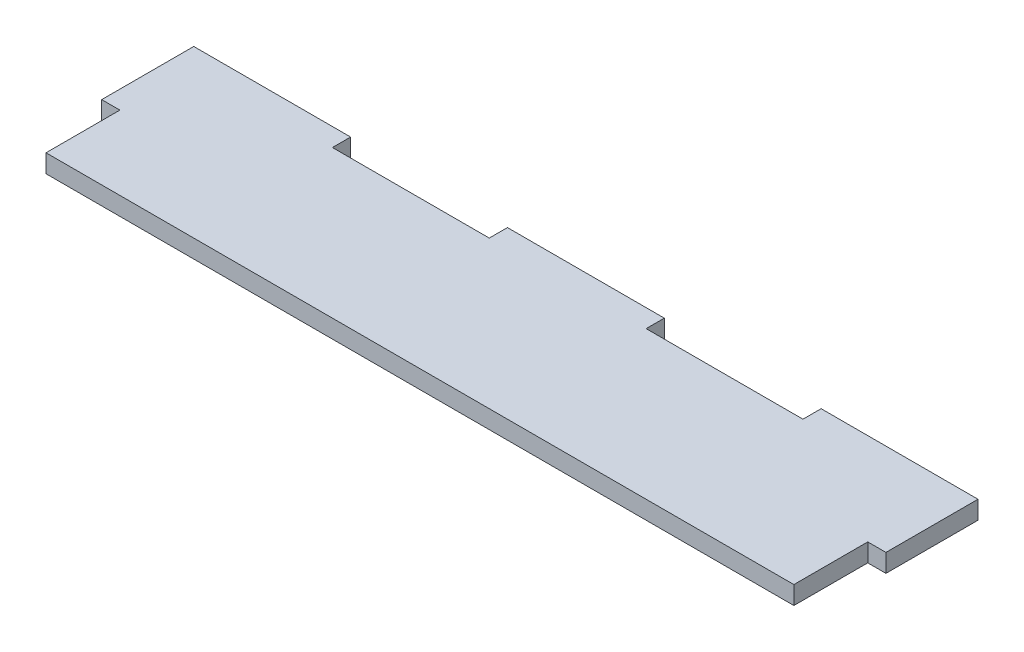
ISO-10303-21;
HEADER;
FILE_DESCRIPTION(('STEP AP214'),'2;1');
FILE_NAME('part.step','',(''),(''),'','','');
FILE_SCHEMA(('AUTOMOTIVE_DESIGN { 1 0 10303 214 1 1 1 1 }'));
ENDSEC;
DATA;
#1=APPLICATION_CONTEXT('core data for automotive mechanical design processes');
#2=APPLICATION_PROTOCOL_DEFINITION('international standard','automotive_design',2000,#1);
#3=PRODUCT_CONTEXT('',#1,'mechanical');
#4=PRODUCT('Part','Part','',(#3));
#5=PRODUCT_RELATED_PRODUCT_CATEGORY('part','',(#4));
#6=PRODUCT_DEFINITION_FORMATION('','',#4);
#7=PRODUCT_DEFINITION_CONTEXT('part definition',#1,'design');
#8=PRODUCT_DEFINITION('design','',#6,#7);
#9=PRODUCT_DEFINITION_SHAPE('','',#8);
#10=(LENGTH_UNIT() NAMED_UNIT(*) SI_UNIT(.MILLI.,.METRE.));
#11=(NAMED_UNIT(*) PLANE_ANGLE_UNIT() SI_UNIT($,.RADIAN.));
#12=(NAMED_UNIT(*) SI_UNIT($,.STERADIAN.) SOLID_ANGLE_UNIT());
#13=UNCERTAINTY_MEASURE_WITH_UNIT(LENGTH_MEASURE(1.E-05),#10,'distance_accuracy_value','');
#14=(GEOMETRIC_REPRESENTATION_CONTEXT(3) GLOBAL_UNCERTAINTY_ASSIGNED_CONTEXT((#13)) GLOBAL_UNIT_ASSIGNED_CONTEXT((#10,
#11,#12)) REPRESENTATION_CONTEXT('',''));
#15=CARTESIAN_POINT('',(0.,0.,0.));
#16=DIRECTION('',(0.,0.,1.));
#17=DIRECTION('',(1.,0.,0.));
#18=AXIS2_PLACEMENT_3D('',#15,#16,#17);
#19=CARTESIAN_POINT('',(0.,10.16,51.4350000000003));
#20=DIRECTION('',(0.,0.,1.));
#21=DIRECTION('',(1.,0.,0.));
#22=AXIS2_PLACEMENT_3D('',#19,#20,#21);
#23=PLANE('',#22);
#24=DIRECTION('',(-1.,0.,0.));
#25=VECTOR('',#24,1.);
#26=CARTESIAN_POINT('',(0.,0.,51.4350000000003));
#27=LINE('',#26,#25);
#28=CARTESIAN_POINT('',(438.15,0.,51.435));
#29=VERTEX_POINT('',#28);
#30=CARTESIAN_POINT('',(427.99,0.,51.435));
#31=VERTEX_POINT('',#30);
#32=EDGE_CURVE('E176',#29,#31,#27,.T.);
#33=ORIENTED_EDGE('',*,*,#32,.F.);
#34=DIRECTION('',(0.,-1.,0.));
#35=VECTOR('',#34,1.);
#36=CARTESIAN_POINT('',(438.15,10.16,51.435));
#37=LINE('',#36,#35);
#38=CARTESIAN_POINT('',(438.15,10.16,51.435));
#39=VERTEX_POINT('',#38);
#40=EDGE_CURVE('E11',#39,#29,#37,.T.);
#41=ORIENTED_EDGE('',*,*,#40,.F.);
#42=DIRECTION('',(-1.,0.,0.));
#43=VECTOR('',#42,1.);
#44=CARTESIAN_POINT('',(0.,10.16,51.4350000000003));
#45=LINE('',#44,#43);
#46=CARTESIAN_POINT('',(427.99,10.16,51.435));
#47=VERTEX_POINT('',#46);
#48=EDGE_CURVE('E216',#39,#47,#45,.T.);
#49=ORIENTED_EDGE('',*,*,#48,.T.);
#50=DIRECTION('',(0.,-1.,0.));
#51=VECTOR('',#50,1.);
#52=CARTESIAN_POINT('',(427.99,10.16,51.435));
#53=LINE('',#52,#51);
#54=EDGE_CURVE('E51',#47,#31,#53,.T.);
#55=ORIENTED_EDGE('',*,*,#54,.T.);
#56=EDGE_LOOP('',(#33,#41,#49,#55));
#57=FACE_BOUND('',#56,.T.);
#58=ADVANCED_FACE('F35',(#57),#23,.T.);
#59=CARTESIAN_POINT('',(438.15,10.16,0.));
#60=DIRECTION('',(1.,0.,0.));
#61=DIRECTION('',(0.,0.,-1.));
#62=AXIS2_PLACEMENT_3D('',#59,#60,#61);
#63=PLANE('',#62);
#64=DIRECTION('',(0.,0.,1.));
#65=VECTOR('',#64,1.);
#66=CARTESIAN_POINT('',(438.15,0.,0.));
#67=LINE('',#66,#65);
#68=CARTESIAN_POINT('',(438.15,0.,0.));
#69=VERTEX_POINT('',#68);
#70=EDGE_CURVE('E178',#69,#29,#67,.T.);
#71=ORIENTED_EDGE('',*,*,#70,.F.);
#72=DIRECTION('',(0.,-1.,0.));
#73=VECTOR('',#72,1.);
#74=CARTESIAN_POINT('',(438.15,10.16,0.));
#75=LINE('',#74,#73);
#76=CARTESIAN_POINT('',(438.15,10.16,0.));
#77=VERTEX_POINT('',#76);
#78=EDGE_CURVE('E43',#77,#69,#75,.T.);
#79=ORIENTED_EDGE('',*,*,#78,.F.);
#80=DIRECTION('',(0.,0.,1.));
#81=VECTOR('',#80,1.);
#82=CARTESIAN_POINT('',(438.15,10.16,0.));
#83=LINE('',#82,#81);
#84=EDGE_CURVE('E262',#77,#39,#83,.T.);
#85=ORIENTED_EDGE('',*,*,#84,.T.);
#86=ORIENTED_EDGE('',*,*,#40,.T.);
#87=EDGE_LOOP('',(#71,#79,#85,#86));
#88=FACE_BOUND('',#87,.T.);
#89=ADVANCED_FACE('F250',(#88),#63,.T.);
#90=CARTESIAN_POINT('',(0.,10.16,0.));
#91=DIRECTION('',(0.,0.,-1.));
#92=DIRECTION('',(-1.,0.,0.));
#93=AXIS2_PLACEMENT_3D('',#90,#91,#92);
#94=PLANE('',#93);
#95=DIRECTION('',(1.,0.,0.));
#96=VECTOR('',#95,1.);
#97=CARTESIAN_POINT('',(0.,0.,0.));
#98=LINE('',#97,#96);
#99=CARTESIAN_POINT('',(350.52,0.,0.));
#100=VERTEX_POINT('',#99);
#101=EDGE_CURVE('E181',#100,#69,#98,.T.);
#102=ORIENTED_EDGE('',*,*,#101,.F.);
#103=DIRECTION('',(0.,-1.,0.));
#104=VECTOR('',#103,1.);
#105=CARTESIAN_POINT('',(350.52,10.16,0.));
#106=LINE('',#105,#104);
#107=CARTESIAN_POINT('',(350.52,10.16,0.));
#108=VERTEX_POINT('',#107);
#109=EDGE_CURVE('E239',#108,#100,#106,.T.);
#110=ORIENTED_EDGE('',*,*,#109,.F.);
#111=DIRECTION('',(1.,0.,0.));
#112=VECTOR('',#111,1.);
#113=CARTESIAN_POINT('',(0.,10.16,0.));
#114=LINE('',#113,#112);
#115=EDGE_CURVE('E246',#108,#77,#114,.T.);
#116=ORIENTED_EDGE('',*,*,#115,.T.);
#117=ORIENTED_EDGE('',*,*,#78,.T.);
#118=EDGE_LOOP('',(#102,#110,#116,#117));
#119=FACE_BOUND('',#118,.T.);
#120=ADVANCED_FACE('F244',(#119),#94,.T.);
#121=CARTESIAN_POINT('',(350.52,10.16,0.));
#122=DIRECTION('',(-1.,0.,0.));
#123=DIRECTION('',(0.,0.,1.));
#124=AXIS2_PLACEMENT_3D('',#121,#122,#123);
#125=PLANE('',#124);
#126=DIRECTION('',(0.,0.,-1.));
#127=VECTOR('',#126,1.);
#128=CARTESIAN_POINT('',(350.52,0.,0.));
#129=LINE('',#128,#127);
#130=CARTESIAN_POINT('',(350.52,0.,10.16));
#131=VERTEX_POINT('',#130);
#132=EDGE_CURVE('E184',#131,#100,#129,.T.);
#133=ORIENTED_EDGE('',*,*,#132,.F.);
#134=DIRECTION('',(0.,-1.,0.));
#135=VECTOR('',#134,1.);
#136=CARTESIAN_POINT('',(350.52,10.16,10.16));
#137=LINE('',#136,#135);
#138=CARTESIAN_POINT('',(350.52,10.16,10.16));
#139=VERTEX_POINT('',#138);
#140=EDGE_CURVE('E237',#139,#131,#137,.T.);
#141=ORIENTED_EDGE('',*,*,#140,.F.);
#142=DIRECTION('',(0.,0.,-1.));
#143=VECTOR('',#142,1.);
#144=CARTESIAN_POINT('',(350.52,10.16,0.));
#145=LINE('',#144,#143);
#146=EDGE_CURVE('E259',#139,#108,#145,.T.);
#147=ORIENTED_EDGE('',*,*,#146,.T.);
#148=ORIENTED_EDGE('',*,*,#109,.T.);
#149=EDGE_LOOP('',(#133,#141,#147,#148));
#150=FACE_BOUND('',#149,.T.);
#151=ADVANCED_FACE('F256',(#150),#125,.T.);
#152=CARTESIAN_POINT('',(0.,10.16,10.16));
#153=DIRECTION('',(0.,0.,-1.));
#154=DIRECTION('',(-1.,0.,0.));
#155=AXIS2_PLACEMENT_3D('',#152,#153,#154);
#156=PLANE('',#155);
#157=DIRECTION('',(1.,0.,0.));
#158=VECTOR('',#157,1.);
#159=CARTESIAN_POINT('',(0.,0.,10.16));
#160=LINE('',#159,#158);
#161=CARTESIAN_POINT('',(262.89,0.,10.16));
#162=VERTEX_POINT('',#161);
#163=EDGE_CURVE('E187',#162,#131,#160,.T.);
#164=ORIENTED_EDGE('',*,*,#163,.F.);
#165=DIRECTION('',(0.,-1.,0.));
#166=VECTOR('',#165,1.);
#167=CARTESIAN_POINT('',(262.89,10.16,10.16));
#168=LINE('',#167,#166);
#169=CARTESIAN_POINT('',(262.89,10.16,10.16));
#170=VERTEX_POINT('',#169);
#171=EDGE_CURVE('E235',#170,#162,#168,.T.);
#172=ORIENTED_EDGE('',*,*,#171,.F.);
#173=DIRECTION('',(1.,0.,0.));
#174=VECTOR('',#173,1.);
#175=CARTESIAN_POINT('',(0.,10.16,10.16));
#176=LINE('',#175,#174);
#177=EDGE_CURVE('E264',#170,#139,#176,.T.);
#178=ORIENTED_EDGE('',*,*,#177,.T.);
#179=ORIENTED_EDGE('',*,*,#140,.T.);
#180=EDGE_LOOP('',(#164,#172,#178,#179));
#181=FACE_BOUND('',#180,.T.);
#182=ADVANCED_FACE('F318',(#181),#156,.T.);
#183=CARTESIAN_POINT('',(262.89,10.16,0.));
#184=DIRECTION('',(1.,0.,0.));
#185=DIRECTION('',(0.,0.,-1.));
#186=AXIS2_PLACEMENT_3D('',#183,#184,#185);
#187=PLANE('',#186);
#188=DIRECTION('',(0.,0.,1.));
#189=VECTOR('',#188,1.);
#190=CARTESIAN_POINT('',(262.89,0.,0.));
#191=LINE('',#190,#189);
#192=CARTESIAN_POINT('',(262.89,0.,0.));
#193=VERTEX_POINT('',#192);
#194=EDGE_CURVE('E190',#193,#162,#191,.T.);
#195=ORIENTED_EDGE('',*,*,#194,.F.);
#196=DIRECTION('',(0.,-1.,0.));
#197=VECTOR('',#196,1.);
#198=CARTESIAN_POINT('',(262.89,10.16,0.));
#199=LINE('',#198,#197);
#200=CARTESIAN_POINT('',(262.89,10.16,0.));
#201=VERTEX_POINT('',#200);
#202=EDGE_CURVE('E233',#201,#193,#199,.T.);
#203=ORIENTED_EDGE('',*,*,#202,.F.);
#204=DIRECTION('',(0.,0.,1.));
#205=VECTOR('',#204,1.);
#206=CARTESIAN_POINT('',(262.89,10.16,0.));
#207=LINE('',#206,#205);
#208=EDGE_CURVE('E270',#201,#170,#207,.T.);
#209=ORIENTED_EDGE('',*,*,#208,.T.);
#210=ORIENTED_EDGE('',*,*,#171,.T.);
#211=EDGE_LOOP('',(#195,#203,#209,#210));
#212=FACE_BOUND('',#211,.T.);
#213=ADVANCED_FACE('F319',(#212),#187,.T.);
#214=CARTESIAN_POINT('',(0.,10.16,0.));
#215=DIRECTION('',(0.,0.,-1.));
#216=DIRECTION('',(-1.,0.,0.));
#217=AXIS2_PLACEMENT_3D('',#214,#215,#216);
#218=PLANE('',#217);
#219=DIRECTION('',(1.,0.,0.));
#220=VECTOR('',#219,1.);
#221=CARTESIAN_POINT('',(0.,0.,0.));
#222=LINE('',#221,#220);
#223=CARTESIAN_POINT('',(175.26,0.,0.));
#224=VERTEX_POINT('',#223);
#225=EDGE_CURVE('E194',#224,#193,#222,.T.);
#226=ORIENTED_EDGE('',*,*,#225,.F.);
#227=DIRECTION('',(0.,-1.,0.));
#228=VECTOR('',#227,1.);
#229=CARTESIAN_POINT('',(175.26,10.16,0.));
#230=LINE('',#229,#228);
#231=CARTESIAN_POINT('',(175.26,10.16,0.));
#232=VERTEX_POINT('',#231);
#233=EDGE_CURVE('E231',#232,#224,#230,.T.);
#234=ORIENTED_EDGE('',*,*,#233,.F.);
#235=DIRECTION('',(1.,0.,0.));
#236=VECTOR('',#235,1.);
#237=CARTESIAN_POINT('',(0.,10.16,0.));
#238=LINE('',#237,#236);
#239=EDGE_CURVE('E274',#232,#201,#238,.T.);
#240=ORIENTED_EDGE('',*,*,#239,.T.);
#241=ORIENTED_EDGE('',*,*,#202,.T.);
#242=EDGE_LOOP('',(#226,#234,#240,#241));
#243=FACE_BOUND('',#242,.T.);
#244=ADVANCED_FACE('F322',(#243),#218,.T.);
#245=CARTESIAN_POINT('',(175.26,10.16,0.));
#246=DIRECTION('',(-1.,0.,0.));
#247=DIRECTION('',(0.,0.,1.));
#248=AXIS2_PLACEMENT_3D('',#245,#246,#247);
#249=PLANE('',#248);
#250=DIRECTION('',(0.,0.,-1.));
#251=VECTOR('',#250,1.);
#252=CARTESIAN_POINT('',(175.26,0.,0.));
#253=LINE('',#252,#251);
#254=CARTESIAN_POINT('',(175.26,0.,10.16));
#255=VERTEX_POINT('',#254);
#256=EDGE_CURVE('E197',#255,#224,#253,.T.);
#257=ORIENTED_EDGE('',*,*,#256,.F.);
#258=DIRECTION('',(0.,-1.,0.));
#259=VECTOR('',#258,1.);
#260=CARTESIAN_POINT('',(175.26,10.16,10.16));
#261=LINE('',#260,#259);
#262=CARTESIAN_POINT('',(175.26,10.16,10.16));
#263=VERTEX_POINT('',#262);
#264=EDGE_CURVE('E229',#263,#255,#261,.T.);
#265=ORIENTED_EDGE('',*,*,#264,.F.);
#266=DIRECTION('',(0.,0.,-1.));
#267=VECTOR('',#266,1.);
#268=CARTESIAN_POINT('',(175.26,10.16,0.));
#269=LINE('',#268,#267);
#270=EDGE_CURVE('E277',#263,#232,#269,.T.);
#271=ORIENTED_EDGE('',*,*,#270,.T.);
#272=ORIENTED_EDGE('',*,*,#233,.T.);
#273=EDGE_LOOP('',(#257,#265,#271,#272));
#274=FACE_BOUND('',#273,.T.);
#275=ADVANCED_FACE('F326',(#274),#249,.T.);
#276=CARTESIAN_POINT('',(87.63,0.,10.16));
#277=VERTEX_POINT('',#276);
#278=EDGE_CURVE('E191',#277,#255,#160,.T.);
#279=ORIENTED_EDGE('',*,*,#278,.F.);
#280=DIRECTION('',(0.,-1.,0.));
#281=VECTOR('',#280,1.);
#282=CARTESIAN_POINT('',(87.63,10.16,10.16));
#283=LINE('',#282,#281);
#284=CARTESIAN_POINT('',(87.63,10.16,10.16));
#285=VERTEX_POINT('',#284);
#286=EDGE_CURVE('E227',#285,#277,#283,.T.);
#287=ORIENTED_EDGE('',*,*,#286,.F.);
#288=EDGE_CURVE('E271',#285,#263,#176,.T.);
#289=ORIENTED_EDGE('',*,*,#288,.T.);
#290=ORIENTED_EDGE('',*,*,#264,.T.);
#291=EDGE_LOOP('',(#279,#287,#289,#290));
#292=FACE_BOUND('',#291,.T.);
#293=ADVANCED_FACE('F330',(#292),#156,.T.);
#294=CARTESIAN_POINT('',(87.63,10.16,0.));
#295=DIRECTION('',(1.,0.,0.));
#296=DIRECTION('',(0.,0.,-1.));
#297=AXIS2_PLACEMENT_3D('',#294,#295,#296);
#298=PLANE('',#297);
#299=DIRECTION('',(0.,0.,1.));
#300=VECTOR('',#299,1.);
#301=CARTESIAN_POINT('',(87.63,0.,0.));
#302=LINE('',#301,#300);
#303=CARTESIAN_POINT('',(87.63,0.,0.));
#304=VERTEX_POINT('',#303);
#305=EDGE_CURVE('E200',#304,#277,#302,.T.);
#306=ORIENTED_EDGE('',*,*,#305,.F.);
#307=DIRECTION('',(0.,-1.,0.));
#308=VECTOR('',#307,1.);
#309=CARTESIAN_POINT('',(87.63,10.16,0.));
#310=LINE('',#309,#308);
#311=CARTESIAN_POINT('',(87.63,10.16,0.));
#312=VERTEX_POINT('',#311);
#313=EDGE_CURVE('E225',#312,#304,#310,.T.);
#314=ORIENTED_EDGE('',*,*,#313,.F.);
#315=DIRECTION('',(0.,0.,1.));
#316=VECTOR('',#315,1.);
#317=CARTESIAN_POINT('',(87.63,10.16,0.));
#318=LINE('',#317,#316);
#319=EDGE_CURVE('E280',#312,#285,#318,.T.);
#320=ORIENTED_EDGE('',*,*,#319,.T.);
#321=ORIENTED_EDGE('',*,*,#286,.T.);
#322=EDGE_LOOP('',(#306,#314,#320,#321));
#323=FACE_BOUND('',#322,.T.);
#324=ADVANCED_FACE('F334',(#323),#298,.T.);
#325=CARTESIAN_POINT('',(0.,10.16,0.));
#326=DIRECTION('',(0.,0.,-1.));
#327=DIRECTION('',(-1.,0.,0.));
#328=AXIS2_PLACEMENT_3D('',#325,#326,#327);
#329=PLANE('',#328);
#330=DIRECTION('',(1.,0.,0.));
#331=VECTOR('',#330,1.);
#332=CARTESIAN_POINT('',(0.,0.,0.));
#333=LINE('',#332,#331);
#334=CARTESIAN_POINT('',(0.,0.,0.));
#335=VERTEX_POINT('',#334);
#336=EDGE_CURVE('E203',#335,#304,#333,.T.);
#337=ORIENTED_EDGE('',*,*,#336,.F.);
#338=DIRECTION('',(0.,-1.,0.));
#339=VECTOR('',#338,1.);
#340=CARTESIAN_POINT('',(0.,10.16,0.));
#341=LINE('',#340,#339);
#342=CARTESIAN_POINT('',(0.,10.16,0.));
#343=VERTEX_POINT('',#342);
#344=EDGE_CURVE('E223',#343,#335,#341,.T.);
#345=ORIENTED_EDGE('',*,*,#344,.F.);
#346=DIRECTION('',(1.,0.,0.));
#347=VECTOR('',#346,1.);
#348=CARTESIAN_POINT('',(0.,10.16,0.));
#349=LINE('',#348,#347);
#350=EDGE_CURVE('E283',#343,#312,#349,.T.);
#351=ORIENTED_EDGE('',*,*,#350,.T.);
#352=ORIENTED_EDGE('',*,*,#313,.T.);
#353=EDGE_LOOP('',(#337,#345,#351,#352));
#354=FACE_BOUND('',#353,.T.);
#355=ADVANCED_FACE('F338',(#354),#329,.T.);
#356=CARTESIAN_POINT('',(0.,10.16,0.));
#357=DIRECTION('',(1.,0.,0.));
#358=DIRECTION('',(0.,0.,-1.));
#359=AXIS2_PLACEMENT_3D('',#356,#357,#358);
#360=PLANE('',#359);
#361=DIRECTION('',(0.,0.,1.));
#362=VECTOR('',#361,1.);
#363=CARTESIAN_POINT('',(0.,0.,0.));
#364=LINE('',#363,#362);
#365=CARTESIAN_POINT('',(0.,0.,51.435));
#366=VERTEX_POINT('',#365);
#367=EDGE_CURVE('E206',#335,#366,#364,.T.);
#368=ORIENTED_EDGE('',*,*,#367,.T.);
#369=DIRECTION('',(0.,-1.,0.));
#370=VECTOR('',#369,1.);
#371=CARTESIAN_POINT('',(0.,10.16,51.435));
#372=LINE('',#371,#370);
#373=CARTESIAN_POINT('',(0.,10.16,51.435));
#374=VERTEX_POINT('',#373);
#375=EDGE_CURVE('E220',#374,#366,#372,.T.);
#376=ORIENTED_EDGE('',*,*,#375,.F.);
#377=DIRECTION('',(0.,0.,1.));
#378=VECTOR('',#377,1.);
#379=CARTESIAN_POINT('',(0.,10.16,0.));
#380=LINE('',#379,#378);
#381=EDGE_CURVE('E286',#343,#374,#380,.T.);
#382=ORIENTED_EDGE('',*,*,#381,.F.);
#383=ORIENTED_EDGE('',*,*,#344,.T.);
#384=EDGE_LOOP('',(#368,#376,#382,#383));
#385=FACE_BOUND('',#384,.T.);
#386=ADVANCED_FACE('F292',(#385),#360,.F.);
#387=CARTESIAN_POINT('',(0.,10.16,51.435));
#388=DIRECTION('',(0.,0.,-1.));
#389=DIRECTION('',(-1.,0.,0.));
#390=AXIS2_PLACEMENT_3D('',#387,#388,#389);
#391=PLANE('',#390);
#392=DIRECTION('',(1.,0.,0.));
#393=VECTOR('',#392,1.);
#394=CARTESIAN_POINT('',(0.,0.,51.435));
#395=LINE('',#394,#393);
#396=CARTESIAN_POINT('',(10.16,0.,51.435));
#397=VERTEX_POINT('',#396);
#398=EDGE_CURVE('E208',#366,#397,#395,.T.);
#399=ORIENTED_EDGE('',*,*,#398,.T.);
#400=DIRECTION('',(0.,-1.,0.));
#401=VECTOR('',#400,1.);
#402=CARTESIAN_POINT('',(10.16,10.16,51.435));
#403=LINE('',#402,#401);
#404=CARTESIAN_POINT('',(10.16,10.16,51.435));
#405=VERTEX_POINT('',#404);
#406=EDGE_CURVE('E168',#405,#397,#403,.T.);
#407=ORIENTED_EDGE('',*,*,#406,.F.);
#408=DIRECTION('',(1.,0.,0.));
#409=VECTOR('',#408,1.);
#410=CARTESIAN_POINT('',(0.,10.16,51.435));
#411=LINE('',#410,#409);
#412=EDGE_CURVE('E156',#374,#405,#411,.T.);
#413=ORIENTED_EDGE('',*,*,#412,.F.);
#414=ORIENTED_EDGE('',*,*,#375,.T.);
#415=EDGE_LOOP('',(#399,#407,#413,#414));
#416=FACE_BOUND('',#415,.T.);
#417=ADVANCED_FACE('F296',(#416),#391,.F.);
#418=CARTESIAN_POINT('',(10.16,10.16,0.));
#419=DIRECTION('',(1.,0.,0.));
#420=DIRECTION('',(0.,0.,-1.));
#421=AXIS2_PLACEMENT_3D('',#418,#419,#420);
#422=PLANE('',#421);
#423=DIRECTION('',(0.,0.,1.));
#424=VECTOR('',#423,1.);
#425=CARTESIAN_POINT('',(10.16,0.,0.));
#426=LINE('',#425,#424);
#427=CARTESIAN_POINT('',(10.16,0.,92.71));
#428=VERTEX_POINT('',#427);
#429=EDGE_CURVE('E165',#397,#428,#426,.T.);
#430=ORIENTED_EDGE('',*,*,#429,.T.);
#431=DIRECTION('',(0.,-1.,0.));
#432=VECTOR('',#431,1.);
#433=CARTESIAN_POINT('',(10.16,10.16,92.71));
#434=LINE('',#433,#432);
#435=CARTESIAN_POINT('',(10.16,10.16,92.71));
#436=VERTEX_POINT('',#435);
#437=EDGE_CURVE('E162',#436,#428,#434,.T.);
#438=ORIENTED_EDGE('',*,*,#437,.F.);
#439=DIRECTION('',(0.,0.,1.));
#440=VECTOR('',#439,1.);
#441=CARTESIAN_POINT('',(10.16,10.16,0.));
#442=LINE('',#441,#440);
#443=EDGE_CURVE('E149',#405,#436,#442,.T.);
#444=ORIENTED_EDGE('',*,*,#443,.F.);
#445=ORIENTED_EDGE('',*,*,#406,.T.);
#446=EDGE_LOOP('',(#430,#438,#444,#445));
#447=FACE_BOUND('',#446,.T.);
#448=ADVANCED_FACE('F163',(#447),#422,.F.);
#449=CARTESIAN_POINT('',(0.,10.16,92.71));
#450=DIRECTION('',(0.,0.,-1.));
#451=DIRECTION('',(-1.,0.,0.));
#452=AXIS2_PLACEMENT_3D('',#449,#450,#451);
#453=PLANE('',#452);
#454=DIRECTION('',(1.,0.,0.));
#455=VECTOR('',#454,1.);
#456=CARTESIAN_POINT('',(0.,0.,92.71));
#457=LINE('',#456,#455);
#458=CARTESIAN_POINT('',(427.99,0.,92.71));
#459=VERTEX_POINT('',#458);
#460=EDGE_CURVE('E211',#428,#459,#457,.T.);
#461=ORIENTED_EDGE('',*,*,#460,.T.);
#462=DIRECTION('',(0.,-1.,0.));
#463=VECTOR('',#462,1.);
#464=CARTESIAN_POINT('',(427.99,10.16,92.71));
#465=LINE('',#464,#463);
#466=CARTESIAN_POINT('',(427.99,10.16,92.71));
#467=VERTEX_POINT('',#466);
#468=EDGE_CURVE('E101',#467,#459,#465,.T.);
#469=ORIENTED_EDGE('',*,*,#468,.F.);
#470=DIRECTION('',(1.,0.,0.));
#471=VECTOR('',#470,1.);
#472=CARTESIAN_POINT('',(0.,10.16,92.71));
#473=LINE('',#472,#471);
#474=EDGE_CURVE('E154',#436,#467,#473,.T.);
#475=ORIENTED_EDGE('',*,*,#474,.F.);
#476=ORIENTED_EDGE('',*,*,#437,.T.);
#477=EDGE_LOOP('',(#461,#469,#475,#476));
#478=FACE_BOUND('',#477,.T.);
#479=ADVANCED_FACE('F170',(#478),#453,.F.);
#480=CARTESIAN_POINT('',(427.99,10.16,0.));
#481=DIRECTION('',(1.,0.,0.));
#482=DIRECTION('',(0.,0.,-1.));
#483=AXIS2_PLACEMENT_3D('',#480,#481,#482);
#484=PLANE('',#483);
#485=DIRECTION('',(0.,0.,1.));
#486=VECTOR('',#485,1.);
#487=CARTESIAN_POINT('',(427.99,0.,0.));
#488=LINE('',#487,#486);
#489=EDGE_CURVE('E213',#31,#459,#488,.T.);
#490=ORIENTED_EDGE('',*,*,#489,.F.);
#491=ORIENTED_EDGE('',*,*,#54,.F.);
#492=DIRECTION('',(0.,0.,1.));
#493=VECTOR('',#492,1.);
#494=CARTESIAN_POINT('',(427.99,10.16,0.));
#495=LINE('',#494,#493);
#496=EDGE_CURVE('E171',#47,#467,#495,.T.);
#497=ORIENTED_EDGE('',*,*,#496,.T.);
#498=ORIENTED_EDGE('',*,*,#468,.T.);
#499=EDGE_LOOP('',(#490,#491,#497,#498));
#500=FACE_BOUND('',#499,.T.);
#501=ADVANCED_FACE('F297',(#500),#484,.T.);
#502=CARTESIAN_POINT('',(0.,10.16,0.));
#503=DIRECTION('',(0.,1.,0.));
#504=DIRECTION('',(0.,0.,1.));
#505=AXIS2_PLACEMENT_3D('',#502,#503,#504);
#506=PLANE('',#505);
#507=ORIENTED_EDGE('',*,*,#48,.F.);
#508=ORIENTED_EDGE('',*,*,#84,.F.);
#509=ORIENTED_EDGE('',*,*,#115,.F.);
#510=ORIENTED_EDGE('',*,*,#146,.F.);
#511=ORIENTED_EDGE('',*,*,#177,.F.);
#512=ORIENTED_EDGE('',*,*,#208,.F.);
#513=ORIENTED_EDGE('',*,*,#239,.F.);
#514=ORIENTED_EDGE('',*,*,#270,.F.);
#515=ORIENTED_EDGE('',*,*,#288,.F.);
#516=ORIENTED_EDGE('',*,*,#319,.F.);
#517=ORIENTED_EDGE('',*,*,#350,.F.);
#518=ORIENTED_EDGE('',*,*,#381,.T.);
#519=ORIENTED_EDGE('',*,*,#412,.T.);
#520=ORIENTED_EDGE('',*,*,#443,.T.);
#521=ORIENTED_EDGE('',*,*,#474,.T.);
#522=ORIENTED_EDGE('',*,*,#496,.F.);
#523=EDGE_LOOP('',(#507,#508,#509,#510,#511,#512,#513,#514,#515,#516,#517,#518,#519,#520,#521,#522));
#524=FACE_BOUND('',#523,.T.);
#525=ADVANCED_FACE('F151',(#524),#506,.T.);
#526=CARTESIAN_POINT('',(0.,0.,0.));
#527=DIRECTION('',(0.,1.,0.));
#528=DIRECTION('',(0.,0.,1.));
#529=AXIS2_PLACEMENT_3D('',#526,#527,#528);
#530=PLANE('',#529);
#531=ORIENTED_EDGE('',*,*,#32,.T.);
#532=ORIENTED_EDGE('',*,*,#489,.T.);
#533=ORIENTED_EDGE('',*,*,#460,.F.);
#534=ORIENTED_EDGE('',*,*,#429,.F.);
#535=ORIENTED_EDGE('',*,*,#398,.F.);
#536=ORIENTED_EDGE('',*,*,#367,.F.);
#537=ORIENTED_EDGE('',*,*,#336,.T.);
#538=ORIENTED_EDGE('',*,*,#305,.T.);
#539=ORIENTED_EDGE('',*,*,#278,.T.);
#540=ORIENTED_EDGE('',*,*,#256,.T.);
#541=ORIENTED_EDGE('',*,*,#225,.T.);
#542=ORIENTED_EDGE('',*,*,#194,.T.);
#543=ORIENTED_EDGE('',*,*,#163,.T.);
#544=ORIENTED_EDGE('',*,*,#132,.T.);
#545=ORIENTED_EDGE('',*,*,#101,.T.);
#546=ORIENTED_EDGE('',*,*,#70,.T.);
#547=EDGE_LOOP('',(#531,#532,#533,#534,#535,#536,#537,#538,#539,#540,#541,#542,#543,#544,#545,#546));
#548=FACE_BOUND('',#547,.T.);
#549=ADVANCED_FACE('F252',(#548),#530,.F.);
#550=CLOSED_SHELL('',(#58,#89,#120,#151,#182,#213,#244,#275,#293,#324,#355,#386,#417,#448,#479,
#501,#525,#549));
#551=MANIFOLD_SOLID_BREP('B2',#550);
#552=ADVANCED_BREP_SHAPE_REPRESENTATION('',(#18,#551),#14);
#553=SHAPE_DEFINITION_REPRESENTATION(#9,#552);
ENDSEC;
END-ISO-10303-21;
